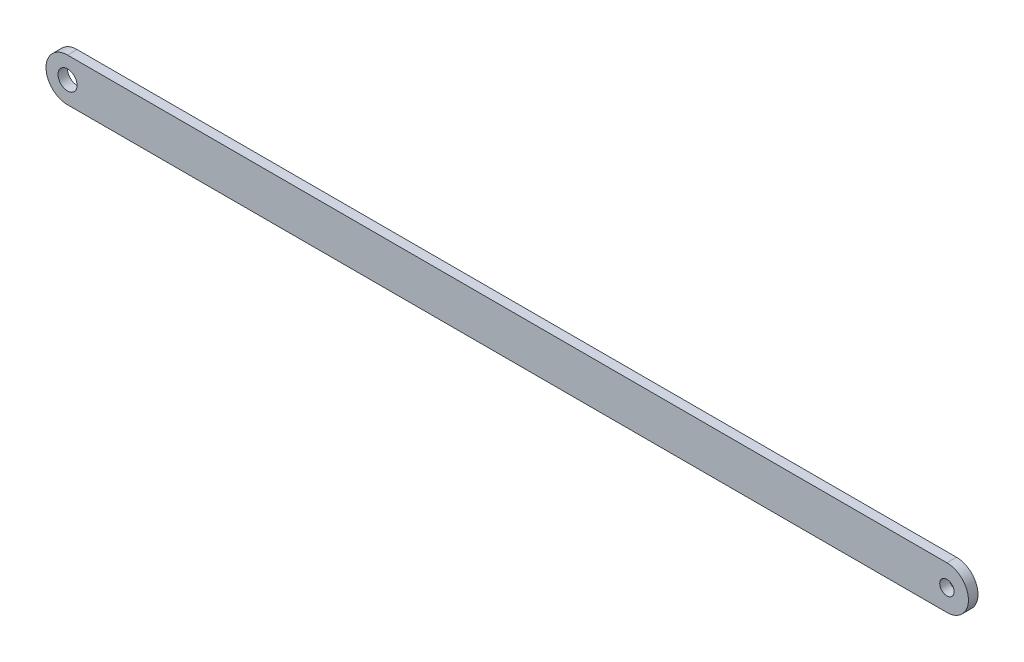
ISO-10303-21;
HEADER;
FILE_DESCRIPTION(('STEP AP214'),'2;1');
FILE_NAME('part.step','',(''),(''),'','','');
FILE_SCHEMA(('AUTOMOTIVE_DESIGN { 1 0 10303 214 1 1 1 1 }'));
ENDSEC;
DATA;
#1=APPLICATION_CONTEXT('core data for automotive mechanical design processes');
#2=APPLICATION_PROTOCOL_DEFINITION('international standard','automotive_design',2000,#1);
#3=PRODUCT_CONTEXT('',#1,'mechanical');
#4=PRODUCT('Part','Part','',(#3));
#5=PRODUCT_RELATED_PRODUCT_CATEGORY('part','',(#4));
#6=PRODUCT_DEFINITION_FORMATION('','',#4);
#7=PRODUCT_DEFINITION_CONTEXT('part definition',#1,'design');
#8=PRODUCT_DEFINITION('design','',#6,#7);
#9=PRODUCT_DEFINITION_SHAPE('','',#8);
#10=(LENGTH_UNIT() NAMED_UNIT(*) SI_UNIT(.MILLI.,.METRE.));
#11=(NAMED_UNIT(*) PLANE_ANGLE_UNIT() SI_UNIT($,.RADIAN.));
#12=(NAMED_UNIT(*) SI_UNIT($,.STERADIAN.) SOLID_ANGLE_UNIT());
#13=UNCERTAINTY_MEASURE_WITH_UNIT(LENGTH_MEASURE(1.E-05),#10,'distance_accuracy_value','');
#14=(GEOMETRIC_REPRESENTATION_CONTEXT(3) GLOBAL_UNCERTAINTY_ASSIGNED_CONTEXT((#13)) GLOBAL_UNIT_ASSIGNED_CONTEXT((#10,
#11,#12)) REPRESENTATION_CONTEXT('',''));
#15=CARTESIAN_POINT('',(0.,0.,0.));
#16=DIRECTION('',(0.,0.,1.));
#17=DIRECTION('',(1.,0.,0.));
#18=AXIS2_PLACEMENT_3D('',#15,#16,#17);
#19=CARTESIAN_POINT('',(0.,9.,4.));
#20=DIRECTION('',(0.,1.,0.));
#21=DIRECTION('',(0.,0.,1.));
#22=AXIS2_PLACEMENT_3D('',#19,#20,#21);
#23=PLANE('',#22);
#24=DIRECTION('',(1.,0.,0.));
#25=VECTOR('',#24,1.);
#26=CARTESIAN_POINT('',(0.,9.,0.));
#27=LINE('',#26,#25);
#28=CARTESIAN_POINT('',(-16.2948185260303,9.,0.));
#29=VERTEX_POINT('',#28);
#30=CARTESIAN_POINT('',(351.23518147397,9.,0.));
#31=VERTEX_POINT('',#30);
#32=EDGE_CURVE('E107',#29,#31,#27,.T.);
#33=ORIENTED_EDGE('',*,*,#32,.F.);
#34=DIRECTION('',(0.,0.,-1.));
#35=VECTOR('',#34,1.);
#36=CARTESIAN_POINT('',(-16.2948185260303,9.,4.));
#37=LINE('',#36,#35);
#38=CARTESIAN_POINT('',(-16.2948185260303,9.,4.));
#39=VERTEX_POINT('',#38);
#40=EDGE_CURVE('E11',#39,#29,#37,.T.);
#41=ORIENTED_EDGE('',*,*,#40,.F.);
#42=DIRECTION('',(1.,0.,0.));
#43=VECTOR('',#42,1.);
#44=CARTESIAN_POINT('',(0.,9.,4.));
#45=LINE('',#44,#43);
#46=CARTESIAN_POINT('',(351.23518147397,9.,4.));
#47=VERTEX_POINT('',#46);
#48=EDGE_CURVE('E91',#39,#47,#45,.T.);
#49=ORIENTED_EDGE('',*,*,#48,.T.);
#50=DIRECTION('',(0.,0.,-1.));
#51=VECTOR('',#50,1.);
#52=CARTESIAN_POINT('',(351.23518147397,9.,4.));
#53=LINE('',#52,#51);
#54=EDGE_CURVE('E53',#47,#31,#53,.T.);
#55=ORIENTED_EDGE('',*,*,#54,.T.);
#56=EDGE_LOOP('',(#33,#41,#49,#55));
#57=FACE_BOUND('',#56,.T.);
#58=ADVANCED_FACE('F36',(#57),#23,.T.);
#59=CARTESIAN_POINT('',(-16.2948185260303,0.,4.));
#60=DIRECTION('',(0.,0.,-1.));
#61=DIRECTION('',(-1.,0.,0.));
#62=AXIS2_PLACEMENT_3D('',#59,#60,#61);
#63=CYLINDRICAL_SURFACE('',#62,9.);
#64=CARTESIAN_POINT('',(-16.2948185260303,0.,0.));
#65=DIRECTION('',(0.,0.,1.));
#66=DIRECTION('',(1.,0.,0.));
#67=AXIS2_PLACEMENT_3D('',#64,#65,#66);
#68=CIRCLE('',#67,9.);
#69=CARTESIAN_POINT('',(-16.2948185260303,-9.,0.));
#70=VERTEX_POINT('',#69);
#71=EDGE_CURVE('E96',#29,#70,#68,.T.);
#72=ORIENTED_EDGE('',*,*,#71,.T.);
#73=DIRECTION('',(0.,0.,-1.));
#74=VECTOR('',#73,1.);
#75=CARTESIAN_POINT('',(-16.2948185260303,-9.,4.));
#76=LINE('',#75,#74);
#77=CARTESIAN_POINT('',(-16.2948185260303,-9.,4.));
#78=VERTEX_POINT('',#77);
#79=EDGE_CURVE('E45',#78,#70,#76,.T.);
#80=ORIENTED_EDGE('',*,*,#79,.F.);
#81=CARTESIAN_POINT('',(-16.2948185260303,0.,4.));
#82=DIRECTION('',(0.,0.,1.));
#83=DIRECTION('',(1.,0.,0.));
#84=AXIS2_PLACEMENT_3D('',#81,#82,#83);
#85=CIRCLE('',#84,9.);
#86=EDGE_CURVE('E87',#39,#78,#85,.T.);
#87=ORIENTED_EDGE('',*,*,#86,.F.);
#88=ORIENTED_EDGE('',*,*,#40,.T.);
#89=EDGE_LOOP('',(#72,#80,#87,#88));
#90=FACE_BOUND('',#89,.T.);
#91=ADVANCED_FACE('F94',(#90),#63,.T.);
#92=CARTESIAN_POINT('',(0.,-9.,4.));
#93=DIRECTION('',(0.,1.,0.));
#94=DIRECTION('',(0.,0.,1.));
#95=AXIS2_PLACEMENT_3D('',#92,#93,#94);
#96=PLANE('',#95);
#97=DIRECTION('',(1.,0.,0.));
#98=VECTOR('',#97,1.);
#99=CARTESIAN_POINT('',(0.,-9.,0.));
#100=LINE('',#99,#98);
#101=CARTESIAN_POINT('',(351.23518147397,-9.,0.));
#102=VERTEX_POINT('',#101);
#103=EDGE_CURVE('E104',#70,#102,#100,.T.);
#104=ORIENTED_EDGE('',*,*,#103,.T.);
#105=DIRECTION('',(0.,0.,-1.));
#106=VECTOR('',#105,1.);
#107=CARTESIAN_POINT('',(351.23518147397,-9.,4.));
#108=LINE('',#107,#106);
#109=CARTESIAN_POINT('',(351.23518147397,-9.,4.));
#110=VERTEX_POINT('',#109);
#111=EDGE_CURVE('E67',#110,#102,#108,.T.);
#112=ORIENTED_EDGE('',*,*,#111,.F.);
#113=DIRECTION('',(1.,0.,0.));
#114=VECTOR('',#113,1.);
#115=CARTESIAN_POINT('',(0.,-9.,4.));
#116=LINE('',#115,#114);
#117=EDGE_CURVE('E79',#78,#110,#116,.T.);
#118=ORIENTED_EDGE('',*,*,#117,.F.);
#119=ORIENTED_EDGE('',*,*,#79,.T.);
#120=EDGE_LOOP('',(#104,#112,#118,#119));
#121=FACE_BOUND('',#120,.T.);
#122=ADVANCED_FACE('F81',(#121),#96,.F.);
#123=CARTESIAN_POINT('',(-16.2948185260303,0.,4.));
#124=DIRECTION('',(0.,0.,-1.));
#125=DIRECTION('',(-1.,0.,0.));
#126=AXIS2_PLACEMENT_3D('',#123,#124,#125);
#127=CYLINDRICAL_SURFACE('',#126,4.);
#128=CARTESIAN_POINT('',(-16.2948185260303,0.,4.));
#129=DIRECTION('',(0.,0.,1.));
#130=DIRECTION('',(1.,0.,0.));
#131=AXIS2_PLACEMENT_3D('',#128,#129,#130);
#132=CIRCLE('',#131,4.);
#133=CARTESIAN_POINT('',(-12.2948185260303,0.,4.));
#134=VERTEX_POINT('',#133);
#135=EDGE_CURVE('E117',#134,#134,#132,.T.);
#136=ORIENTED_EDGE('',*,*,#135,.T.);
#137=EDGE_LOOP('',(#136));
#138=FACE_BOUND('',#137,.T.);
#139=CARTESIAN_POINT('',(-16.2948185260303,0.,0.));
#140=DIRECTION('',(0.,0.,1.));
#141=DIRECTION('',(1.,0.,0.));
#142=AXIS2_PLACEMENT_3D('',#139,#140,#141);
#143=CIRCLE('',#142,4.);
#144=CARTESIAN_POINT('',(-12.2948185260303,0.,0.));
#145=VERTEX_POINT('',#144);
#146=EDGE_CURVE('E109',#145,#145,#143,.T.);
#147=ORIENTED_EDGE('',*,*,#146,.F.);
#148=EDGE_LOOP('',(#147));
#149=FACE_BOUND('',#148,.T.);
#150=ADVANCED_FACE('F132',(#138,#149),#127,.F.);
#151=CARTESIAN_POINT('',(351.23518147397,0.,4.));
#152=DIRECTION('',(0.,0.,-1.));
#153=DIRECTION('',(-1.,0.,0.));
#154=AXIS2_PLACEMENT_3D('',#151,#152,#153);
#155=CYLINDRICAL_SURFACE('',#154,2.99999999999999);
#156=CARTESIAN_POINT('',(351.23518147397,0.,4.));
#157=DIRECTION('',(0.,0.,1.));
#158=DIRECTION('',(1.,0.,0.));
#159=AXIS2_PLACEMENT_3D('',#156,#157,#158);
#160=CIRCLE('',#159,2.99999999999999);
#161=CARTESIAN_POINT('',(354.23518147397,0.,4.));
#162=VERTEX_POINT('',#161);
#163=EDGE_CURVE('E103',#162,#162,#160,.T.);
#164=ORIENTED_EDGE('',*,*,#163,.T.);
#165=EDGE_LOOP('',(#164));
#166=FACE_BOUND('',#165,.T.);
#167=CARTESIAN_POINT('',(351.23518147397,0.,0.));
#168=DIRECTION('',(0.,0.,1.));
#169=DIRECTION('',(1.,0.,0.));
#170=AXIS2_PLACEMENT_3D('',#167,#168,#169);
#171=CIRCLE('',#170,2.99999999999999);
#172=CARTESIAN_POINT('',(354.23518147397,0.,0.));
#173=VERTEX_POINT('',#172);
#174=EDGE_CURVE('E112',#173,#173,#171,.T.);
#175=ORIENTED_EDGE('',*,*,#174,.F.);
#176=EDGE_LOOP('',(#175));
#177=FACE_BOUND('',#176,.T.);
#178=ADVANCED_FACE('F38',(#166,#177),#155,.F.);
#179=CARTESIAN_POINT('',(351.23518147397,0.,4.));
#180=DIRECTION('',(0.,0.,-1.));
#181=DIRECTION('',(-1.,0.,0.));
#182=AXIS2_PLACEMENT_3D('',#179,#180,#181);
#183=CYLINDRICAL_SURFACE('',#182,9.);
#184=CARTESIAN_POINT('',(351.23518147397,0.,0.));
#185=DIRECTION('',(0.,0.,1.));
#186=DIRECTION('',(1.,0.,0.));
#187=AXIS2_PLACEMENT_3D('',#184,#185,#186);
#188=CIRCLE('',#187,9.);
#189=EDGE_CURVE('E100',#31,#102,#188,.F.);
#190=ORIENTED_EDGE('',*,*,#189,.F.);
#191=ORIENTED_EDGE('',*,*,#54,.F.);
#192=CARTESIAN_POINT('',(351.23518147397,0.,4.));
#193=DIRECTION('',(0.,0.,1.));
#194=DIRECTION('',(1.,0.,0.));
#195=AXIS2_PLACEMENT_3D('',#192,#193,#194);
#196=CIRCLE('',#195,9.);
#197=EDGE_CURVE('E86',#47,#110,#196,.F.);
#198=ORIENTED_EDGE('',*,*,#197,.T.);
#199=ORIENTED_EDGE('',*,*,#111,.T.);
#200=EDGE_LOOP('',(#190,#191,#198,#199));
#201=FACE_BOUND('',#200,.T.);
#202=ADVANCED_FACE('F128',(#201),#183,.T.);
#203=CARTESIAN_POINT('',(0.,0.,4.));
#204=DIRECTION('',(0.,0.,1.));
#205=DIRECTION('',(1.,0.,0.));
#206=AXIS2_PLACEMENT_3D('',#203,#204,#205);
#207=PLANE('',#206);
#208=ORIENTED_EDGE('',*,*,#163,.F.);
#209=EDGE_LOOP('',(#208));
#210=FACE_BOUND('',#209,.T.);
#211=ORIENTED_EDGE('',*,*,#135,.F.);
#212=EDGE_LOOP('',(#211));
#213=FACE_BOUND('',#212,.T.);
#214=ORIENTED_EDGE('',*,*,#48,.F.);
#215=ORIENTED_EDGE('',*,*,#86,.T.);
#216=ORIENTED_EDGE('',*,*,#117,.T.);
#217=ORIENTED_EDGE('',*,*,#197,.F.);
#218=EDGE_LOOP('',(#214,#215,#216,#217));
#219=FACE_BOUND('',#218,.T.);
#220=ADVANCED_FACE('F90',(#210,#213,#219),#207,.T.);
#221=CARTESIAN_POINT('',(0.,0.,0.));
#222=DIRECTION('',(0.,0.,1.));
#223=DIRECTION('',(1.,0.,0.));
#224=AXIS2_PLACEMENT_3D('',#221,#222,#223);
#225=PLANE('',#224);
#226=ORIENTED_EDGE('',*,*,#174,.T.);
#227=EDGE_LOOP('',(#226));
#228=FACE_BOUND('',#227,.T.);
#229=ORIENTED_EDGE('',*,*,#146,.T.);
#230=EDGE_LOOP('',(#229));
#231=FACE_BOUND('',#230,.T.);
#232=ORIENTED_EDGE('',*,*,#32,.T.);
#233=ORIENTED_EDGE('',*,*,#189,.T.);
#234=ORIENTED_EDGE('',*,*,#103,.F.);
#235=ORIENTED_EDGE('',*,*,#71,.F.);
#236=EDGE_LOOP('',(#232,#233,#234,#235));
#237=FACE_BOUND('',#236,.T.);
#238=ADVANCED_FACE('F127',(#228,#231,#237),#225,.F.);
#239=CLOSED_SHELL('',(#58,#91,#122,#150,#178,#202,#220,#238));
#240=MANIFOLD_SOLID_BREP('B2',#239);
#241=ADVANCED_BREP_SHAPE_REPRESENTATION('',(#18,#240),#14);
#242=SHAPE_DEFINITION_REPRESENTATION(#9,#241);
ENDSEC;
END-ISO-10303-21;
